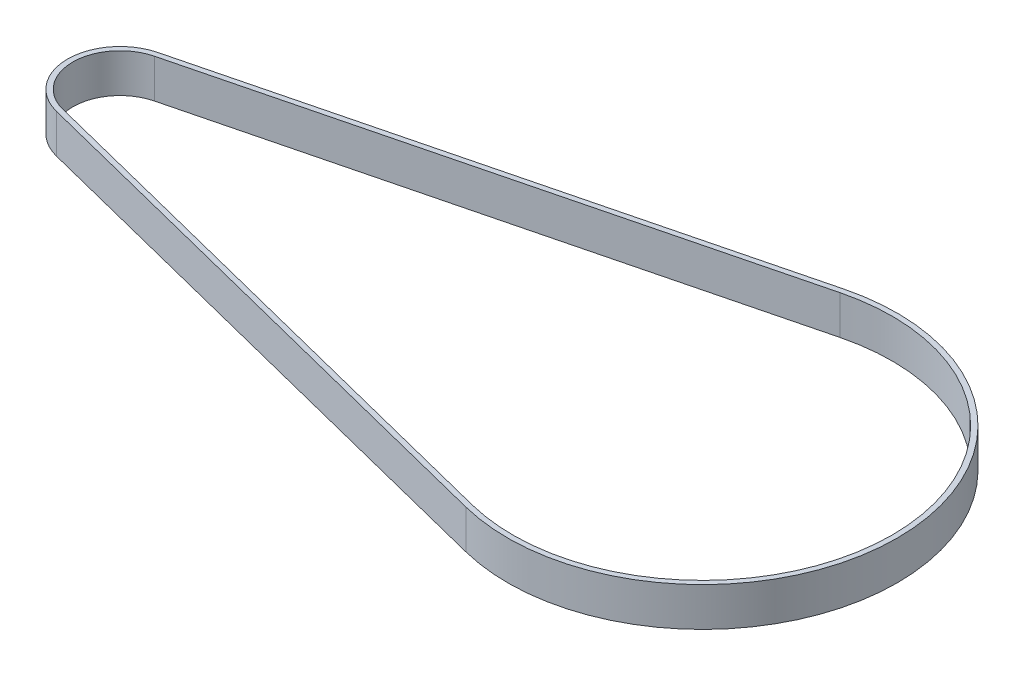
ISO-10303-21;
HEADER;
FILE_DESCRIPTION(('STEP AP214'),'2;1');
FILE_NAME('part.step','',(''),(''),'','','');
FILE_SCHEMA(('AUTOMOTIVE_DESIGN { 1 0 10303 214 1 1 1 1 }'));
ENDSEC;
DATA;
#1=APPLICATION_CONTEXT('core data for automotive mechanical design processes');
#2=APPLICATION_PROTOCOL_DEFINITION('international standard','automotive_design',2000,#1);
#3=PRODUCT_CONTEXT('',#1,'mechanical');
#4=PRODUCT('Part','Part','',(#3));
#5=PRODUCT_RELATED_PRODUCT_CATEGORY('part','',(#4));
#6=PRODUCT_DEFINITION_FORMATION('','',#4);
#7=PRODUCT_DEFINITION_CONTEXT('part definition',#1,'design');
#8=PRODUCT_DEFINITION('design','',#6,#7);
#9=PRODUCT_DEFINITION_SHAPE('','',#8);
#10=(LENGTH_UNIT() NAMED_UNIT(*) SI_UNIT(.MILLI.,.METRE.));
#11=(NAMED_UNIT(*) PLANE_ANGLE_UNIT() SI_UNIT($,.RADIAN.));
#12=(NAMED_UNIT(*) SI_UNIT($,.STERADIAN.) SOLID_ANGLE_UNIT());
#13=UNCERTAINTY_MEASURE_WITH_UNIT(LENGTH_MEASURE(1.E-05),#10,'distance_accuracy_value','');
#14=(GEOMETRIC_REPRESENTATION_CONTEXT(3) GLOBAL_UNCERTAINTY_ASSIGNED_CONTEXT((#13)) GLOBAL_UNIT_ASSIGNED_CONTEXT((#10,
#11,#12)) REPRESENTATION_CONTEXT('',''));
#15=CARTESIAN_POINT('',(0.,0.,0.));
#16=DIRECTION('',(0.,0.,1.));
#17=DIRECTION('',(1.,0.,0.));
#18=AXIS2_PLACEMENT_3D('',#15,#16,#17);
#19=CARTESIAN_POINT('',(-90.,6.,0.));
#20=DIRECTION('',(0.,1.,0.));
#21=DIRECTION('',(0.,0.,1.));
#22=AXIS2_PLACEMENT_3D('',#19,#20,#21);
#23=PLANE('',#22);
#24=CARTESIAN_POINT('',(-90.,6.,0.));
#25=DIRECTION('',(0.,1.,0.));
#26=DIRECTION('',(0.,0.,1.));
#27=AXIS2_PLACEMENT_3D('',#24,#25,#26);
#28=CIRCLE('',#27,8.1);
#29=CARTESIAN_POINT('',(-91.98,6.,-7.85427272253771));
#30=VERTEX_POINT('',#29);
#31=CARTESIAN_POINT('',(-91.98,6.,7.85427272253772));
#32=VERTEX_POINT('',#31);
#33=EDGE_CURVE('E133',#30,#32,#28,.T.);
#34=ORIENTED_EDGE('',*,*,#33,.T.);
#35=DIRECTION('',(0.96966329907873,0.,0.244444444444444));
#36=VECTOR('',#35,1.);
#37=CARTESIAN_POINT('',(-91.98,6.,7.85427272253772));
#38=LINE('',#37,#36);
#39=CARTESIAN_POINT('',(-7.3577777777778,6.,29.1868653022698));
#40=VERTEX_POINT('',#39);
#41=EDGE_CURVE('E136',#32,#40,#38,.T.);
#42=ORIENTED_EDGE('',*,*,#41,.T.);
#43=CARTESIAN_POINT('',(0.,6.,0.));
#44=DIRECTION('',(0.,1.,0.));
#45=DIRECTION('',(0.,0.,1.));
#46=AXIS2_PLACEMENT_3D('',#43,#44,#45);
#47=CIRCLE('',#46,30.1);
#48=CARTESIAN_POINT('',(-7.35777777777776,6.,-29.1868653022698));
#49=VERTEX_POINT('',#48);
#50=EDGE_CURVE('E139',#40,#49,#47,.T.);
#51=ORIENTED_EDGE('',*,*,#50,.T.);
#52=DIRECTION('',(-0.96966329907873,0.,0.244444444444444));
#53=VECTOR('',#52,1.);
#54=CARTESIAN_POINT('',(-91.98,6.,-7.85427272253771));
#55=LINE('',#54,#53);
#56=EDGE_CURVE('E141',#49,#30,#55,.T.);
#57=ORIENTED_EDGE('',*,*,#56,.T.);
#58=EDGE_LOOP('',(#34,#42,#51,#57));
#59=FACE_BOUND('',#58,.T.);
#60=DIRECTION('',(0.96966329907873,0.,0.244444444444445));
#61=VECTOR('',#60,1.);
#62=CARTESIAN_POINT('',(-91.7844444444444,6.,7.07854208327474));
#63=LINE('',#62,#61);
#64=CARTESIAN_POINT('',(-91.7844444444444,6.,7.07854208327474));
#65=VERTEX_POINT('',#64);
#66=CARTESIAN_POINT('',(-7.16222222222223,6.,28.4111346630068));
#67=VERTEX_POINT('',#66);
#68=EDGE_CURVE('E105',#65,#67,#63,.T.);
#69=ORIENTED_EDGE('',*,*,#68,.F.);
#70=CARTESIAN_POINT('',(-90.,6.,0.));
#71=DIRECTION('',(0.,1.,0.));
#72=DIRECTION('',(0.,0.,1.));
#73=AXIS2_PLACEMENT_3D('',#70,#71,#72);
#74=CIRCLE('',#73,7.30000000000001);
#75=CARTESIAN_POINT('',(-91.7844444444444,6.,-7.07854208327473));
#76=VERTEX_POINT('',#75);
#77=EDGE_CURVE('E97',#76,#65,#74,.T.);
#78=ORIENTED_EDGE('',*,*,#77,.F.);
#79=DIRECTION('',(-0.96966329907873,0.,0.244444444444444));
#80=VECTOR('',#79,1.);
#81=CARTESIAN_POINT('',(-91.7844444444444,6.,-7.07854208327473));
#82=LINE('',#81,#80);
#83=CARTESIAN_POINT('',(-7.16222222222225,6.,-28.4111346630068));
#84=VERTEX_POINT('',#83);
#85=EDGE_CURVE('E119',#84,#76,#82,.T.);
#86=ORIENTED_EDGE('',*,*,#85,.F.);
#87=CARTESIAN_POINT('',(0.,6.,0.));
#88=DIRECTION('',(0.,1.,0.));
#89=DIRECTION('',(0.,0.,1.));
#90=AXIS2_PLACEMENT_3D('',#87,#88,#89);
#91=CIRCLE('',#90,29.3);
#92=EDGE_CURVE('E117',#67,#84,#91,.T.);
#93=ORIENTED_EDGE('',*,*,#92,.F.);
#94=EDGE_LOOP('',(#69,#78,#86,#93));
#95=FACE_BOUND('',#94,.T.);
#96=ADVANCED_FACE('F32',(#59,#95),#23,.T.);
#97=CARTESIAN_POINT('',(-90.,0.,0.));
#98=DIRECTION('',(0.,1.,0.));
#99=DIRECTION('',(0.,0.,1.));
#100=AXIS2_PLACEMENT_3D('',#97,#98,#99);
#101=PLANE('',#100);
#102=CARTESIAN_POINT('',(-90.,0.,0.));
#103=DIRECTION('',(0.,1.,0.));
#104=DIRECTION('',(0.,0.,1.));
#105=AXIS2_PLACEMENT_3D('',#102,#103,#104);
#106=CIRCLE('',#105,8.1);
#107=CARTESIAN_POINT('',(-91.98,0.,-7.85427272253771));
#108=VERTEX_POINT('',#107);
#109=CARTESIAN_POINT('',(-91.98,0.,7.85427272253772));
#110=VERTEX_POINT('',#109);
#111=EDGE_CURVE('E113',#108,#110,#106,.T.);
#112=ORIENTED_EDGE('',*,*,#111,.F.);
#113=DIRECTION('',(-0.96966329907873,0.,0.244444444444444));
#114=VECTOR('',#113,1.);
#115=CARTESIAN_POINT('',(-91.98,0.,-7.85427272253771));
#116=LINE('',#115,#114);
#117=CARTESIAN_POINT('',(-7.35777777777776,0.,-29.1868653022698));
#118=VERTEX_POINT('',#117);
#119=EDGE_CURVE('E137',#118,#108,#116,.T.);
#120=ORIENTED_EDGE('',*,*,#119,.F.);
#121=CARTESIAN_POINT('',(0.,0.,0.));
#122=DIRECTION('',(0.,1.,0.));
#123=DIRECTION('',(0.,0.,1.));
#124=AXIS2_PLACEMENT_3D('',#121,#122,#123);
#125=CIRCLE('',#124,30.1);
#126=CARTESIAN_POINT('',(-7.3577777777778,0.,29.1868653022698));
#127=VERTEX_POINT('',#126);
#128=EDGE_CURVE('E148',#127,#118,#125,.T.);
#129=ORIENTED_EDGE('',*,*,#128,.F.);
#130=DIRECTION('',(0.96966329907873,0.,0.244444444444444));
#131=VECTOR('',#130,1.);
#132=CARTESIAN_POINT('',(-91.98,0.,7.85427272253772));
#133=LINE('',#132,#131);
#134=EDGE_CURVE('E146',#110,#127,#133,.T.);
#135=ORIENTED_EDGE('',*,*,#134,.F.);
#136=EDGE_LOOP('',(#112,#120,#129,#135));
#137=FACE_BOUND('',#136,.T.);
#138=CARTESIAN_POINT('',(-90.,0.,0.));
#139=DIRECTION('',(0.,1.,0.));
#140=DIRECTION('',(0.,0.,1.));
#141=AXIS2_PLACEMENT_3D('',#138,#139,#140);
#142=CIRCLE('',#141,7.30000000000001);
#143=CARTESIAN_POINT('',(-91.7844444444444,0.,-7.07854208327473));
#144=VERTEX_POINT('',#143);
#145=CARTESIAN_POINT('',(-91.7844444444444,0.,7.07854208327474));
#146=VERTEX_POINT('',#145);
#147=EDGE_CURVE('E55',#144,#146,#142,.T.);
#148=ORIENTED_EDGE('',*,*,#147,.T.);
#149=DIRECTION('',(0.96966329907873,0.,0.244444444444445));
#150=VECTOR('',#149,1.);
#151=CARTESIAN_POINT('',(-91.7844444444444,0.,7.07854208327474));
#152=LINE('',#151,#150);
#153=CARTESIAN_POINT('',(-7.16222222222223,0.,28.4111346630068));
#154=VERTEX_POINT('',#153);
#155=EDGE_CURVE('E112',#146,#154,#152,.T.);
#156=ORIENTED_EDGE('',*,*,#155,.T.);
#157=CARTESIAN_POINT('',(0.,0.,0.));
#158=DIRECTION('',(0.,1.,0.));
#159=DIRECTION('',(0.,0.,1.));
#160=AXIS2_PLACEMENT_3D('',#157,#158,#159);
#161=CIRCLE('',#160,29.3);
#162=CARTESIAN_POINT('',(-7.16222222222223,0.,-28.4111346630068));
#163=VERTEX_POINT('',#162);
#164=EDGE_CURVE('E125',#154,#163,#161,.T.);
#165=ORIENTED_EDGE('',*,*,#164,.T.);
#166=DIRECTION('',(-0.96966329907873,0.,0.244444444444444));
#167=VECTOR('',#166,1.);
#168=CARTESIAN_POINT('',(-91.7844444444444,0.,-7.07854208327473));
#169=LINE('',#168,#167);
#170=EDGE_CURVE('E106',#163,#144,#169,.T.);
#171=ORIENTED_EDGE('',*,*,#170,.T.);
#172=EDGE_LOOP('',(#148,#156,#165,#171));
#173=FACE_BOUND('',#172,.T.);
#174=ADVANCED_FACE('F166',(#137,#173),#101,.F.);
#175=CARTESIAN_POINT('',(-90.,6.,0.));
#176=DIRECTION('',(0.,-1.,0.));
#177=DIRECTION('',(0.,0.,-1.));
#178=AXIS2_PLACEMENT_3D('',#175,#176,#177);
#179=CYLINDRICAL_SURFACE('',#178,8.1);
#180=ORIENTED_EDGE('',*,*,#111,.T.);
#181=DIRECTION('',(0.,-1.,0.));
#182=VECTOR('',#181,1.);
#183=CARTESIAN_POINT('',(-91.98,6.,7.85427272253772));
#184=LINE('',#183,#182);
#185=EDGE_CURVE('E11',#32,#110,#184,.T.);
#186=ORIENTED_EDGE('',*,*,#185,.F.);
#187=ORIENTED_EDGE('',*,*,#33,.F.);
#188=DIRECTION('',(0.,-1.,0.));
#189=VECTOR('',#188,1.);
#190=CARTESIAN_POINT('',(-91.98,6.,-7.85427272253771));
#191=LINE('',#190,#189);
#192=EDGE_CURVE('E143',#30,#108,#191,.T.);
#193=ORIENTED_EDGE('',*,*,#192,.T.);
#194=EDGE_LOOP('',(#180,#186,#187,#193));
#195=FACE_BOUND('',#194,.T.);
#196=ADVANCED_FACE('F34',(#195),#179,.T.);
#197=CARTESIAN_POINT('',(-91.98,6.,7.85427272253772));
#198=DIRECTION('',(0.244444444444444,0.,-0.96966329907873));
#199=DIRECTION('',(-0.96966329907873,0.,-0.244444444444444));
#200=AXIS2_PLACEMENT_3D('',#197,#198,#199);
#201=PLANE('',#200);
#202=ORIENTED_EDGE('',*,*,#134,.T.);
#203=DIRECTION('',(0.,-1.,0.));
#204=VECTOR('',#203,1.);
#205=CARTESIAN_POINT('',(-7.3577777777778,6.,29.1868653022698));
#206=LINE('',#205,#204);
#207=EDGE_CURVE('E40',#40,#127,#206,.T.);
#208=ORIENTED_EDGE('',*,*,#207,.F.);
#209=ORIENTED_EDGE('',*,*,#41,.F.);
#210=ORIENTED_EDGE('',*,*,#185,.T.);
#211=EDGE_LOOP('',(#202,#208,#209,#210));
#212=FACE_BOUND('',#211,.T.);
#213=ADVANCED_FACE('F176',(#212),#201,.F.);
#214=CARTESIAN_POINT('',(0.,6.,0.));
#215=DIRECTION('',(0.,-1.,0.));
#216=DIRECTION('',(0.,0.,-1.));
#217=AXIS2_PLACEMENT_3D('',#214,#215,#216);
#218=CYLINDRICAL_SURFACE('',#217,30.1);
#219=ORIENTED_EDGE('',*,*,#128,.T.);
#220=DIRECTION('',(0.,-1.,0.));
#221=VECTOR('',#220,1.);
#222=CARTESIAN_POINT('',(-7.35777777777776,6.,-29.1868653022698));
#223=LINE('',#222,#221);
#224=EDGE_CURVE('E153',#49,#118,#223,.T.);
#225=ORIENTED_EDGE('',*,*,#224,.F.);
#226=ORIENTED_EDGE('',*,*,#50,.F.);
#227=ORIENTED_EDGE('',*,*,#207,.T.);
#228=EDGE_LOOP('',(#219,#225,#226,#227));
#229=FACE_BOUND('',#228,.T.);
#230=ADVANCED_FACE('F160',(#229),#218,.T.);
#231=CARTESIAN_POINT('',(-91.98,6.,-7.85427272253771));
#232=DIRECTION('',(0.244444444444444,0.,0.96966329907873));
#233=DIRECTION('',(0.96966329907873,0.,-0.244444444444444));
#234=AXIS2_PLACEMENT_3D('',#231,#232,#233);
#235=PLANE('',#234);
#236=ORIENTED_EDGE('',*,*,#119,.T.);
#237=ORIENTED_EDGE('',*,*,#192,.F.);
#238=ORIENTED_EDGE('',*,*,#56,.F.);
#239=ORIENTED_EDGE('',*,*,#224,.T.);
#240=EDGE_LOOP('',(#236,#237,#238,#239));
#241=FACE_BOUND('',#240,.T.);
#242=ADVANCED_FACE('F170',(#241),#235,.F.);
#243=CARTESIAN_POINT('',(-90.,6.,0.));
#244=DIRECTION('',(0.,-1.,0.));
#245=DIRECTION('',(0.,0.,-1.));
#246=AXIS2_PLACEMENT_3D('',#243,#244,#245);
#247=CYLINDRICAL_SURFACE('',#246,7.30000000000001);
#248=ORIENTED_EDGE('',*,*,#147,.F.);
#249=DIRECTION('',(0.,-1.,0.));
#250=VECTOR('',#249,1.);
#251=CARTESIAN_POINT('',(-91.7844444444444,6.,-7.07854208327473));
#252=LINE('',#251,#250);
#253=EDGE_CURVE('E101',#76,#144,#252,.T.);
#254=ORIENTED_EDGE('',*,*,#253,.F.);
#255=ORIENTED_EDGE('',*,*,#77,.T.);
#256=DIRECTION('',(0.,-1.,0.));
#257=VECTOR('',#256,1.);
#258=CARTESIAN_POINT('',(-91.7844444444444,6.,7.07854208327474));
#259=LINE('',#258,#257);
#260=EDGE_CURVE('E100',#65,#146,#259,.T.);
#261=ORIENTED_EDGE('',*,*,#260,.T.);
#262=EDGE_LOOP('',(#248,#254,#255,#261));
#263=FACE_BOUND('',#262,.T.);
#264=ADVANCED_FACE('F99',(#263),#247,.F.);
#265=CARTESIAN_POINT('',(-91.7844444444444,6.,7.07854208327474));
#266=DIRECTION('',(0.244444444444445,0.,-0.96966329907873));
#267=DIRECTION('',(-0.96966329907873,0.,-0.244444444444445));
#268=AXIS2_PLACEMENT_3D('',#265,#266,#267);
#269=PLANE('',#268);
#270=ORIENTED_EDGE('',*,*,#155,.F.);
#271=ORIENTED_EDGE('',*,*,#260,.F.);
#272=ORIENTED_EDGE('',*,*,#68,.T.);
#273=DIRECTION('',(0.,-1.,0.));
#274=VECTOR('',#273,1.);
#275=CARTESIAN_POINT('',(-7.16222222222223,6.,28.4111346630068));
#276=LINE('',#275,#274);
#277=EDGE_CURVE('E114',#67,#154,#276,.T.);
#278=ORIENTED_EDGE('',*,*,#277,.T.);
#279=EDGE_LOOP('',(#270,#271,#272,#278));
#280=FACE_BOUND('',#279,.T.);
#281=ADVANCED_FACE('F109',(#280),#269,.T.);
#282=CARTESIAN_POINT('',(0.,6.,0.));
#283=DIRECTION('',(0.,-1.,0.));
#284=DIRECTION('',(0.,0.,-1.));
#285=AXIS2_PLACEMENT_3D('',#282,#283,#284);
#286=CYLINDRICAL_SURFACE('',#285,29.3);
#287=ORIENTED_EDGE('',*,*,#164,.F.);
#288=ORIENTED_EDGE('',*,*,#277,.F.);
#289=ORIENTED_EDGE('',*,*,#92,.T.);
#290=DIRECTION('',(0.,-1.,0.));
#291=VECTOR('',#290,1.);
#292=CARTESIAN_POINT('',(-7.16222222222223,6.,-28.4111346630068));
#293=LINE('',#292,#291);
#294=EDGE_CURVE('E47',#84,#163,#293,.T.);
#295=ORIENTED_EDGE('',*,*,#294,.T.);
#296=EDGE_LOOP('',(#287,#288,#289,#295));
#297=FACE_BOUND('',#296,.T.);
#298=ADVANCED_FACE('F199',(#297),#286,.F.);
#299=CARTESIAN_POINT('',(-91.7844444444444,6.,-7.07854208327473));
#300=DIRECTION('',(0.244444444444444,0.,0.96966329907873));
#301=DIRECTION('',(0.96966329907873,0.,-0.244444444444444));
#302=AXIS2_PLACEMENT_3D('',#299,#300,#301);
#303=PLANE('',#302);
#304=ORIENTED_EDGE('',*,*,#170,.F.);
#305=ORIENTED_EDGE('',*,*,#294,.F.);
#306=ORIENTED_EDGE('',*,*,#85,.T.);
#307=ORIENTED_EDGE('',*,*,#253,.T.);
#308=EDGE_LOOP('',(#304,#305,#306,#307));
#309=FACE_BOUND('',#308,.T.);
#310=ADVANCED_FACE('F203',(#309),#303,.T.);
#311=CLOSED_SHELL('',(#96,#174,#196,#213,#230,#242,#264,#281,#298,#310));
#312=MANIFOLD_SOLID_BREP('B2',#311);
#313=ADVANCED_BREP_SHAPE_REPRESENTATION('',(#18,#312),#14);
#314=SHAPE_DEFINITION_REPRESENTATION(#9,#313);
ENDSEC;
END-ISO-10303-21;
